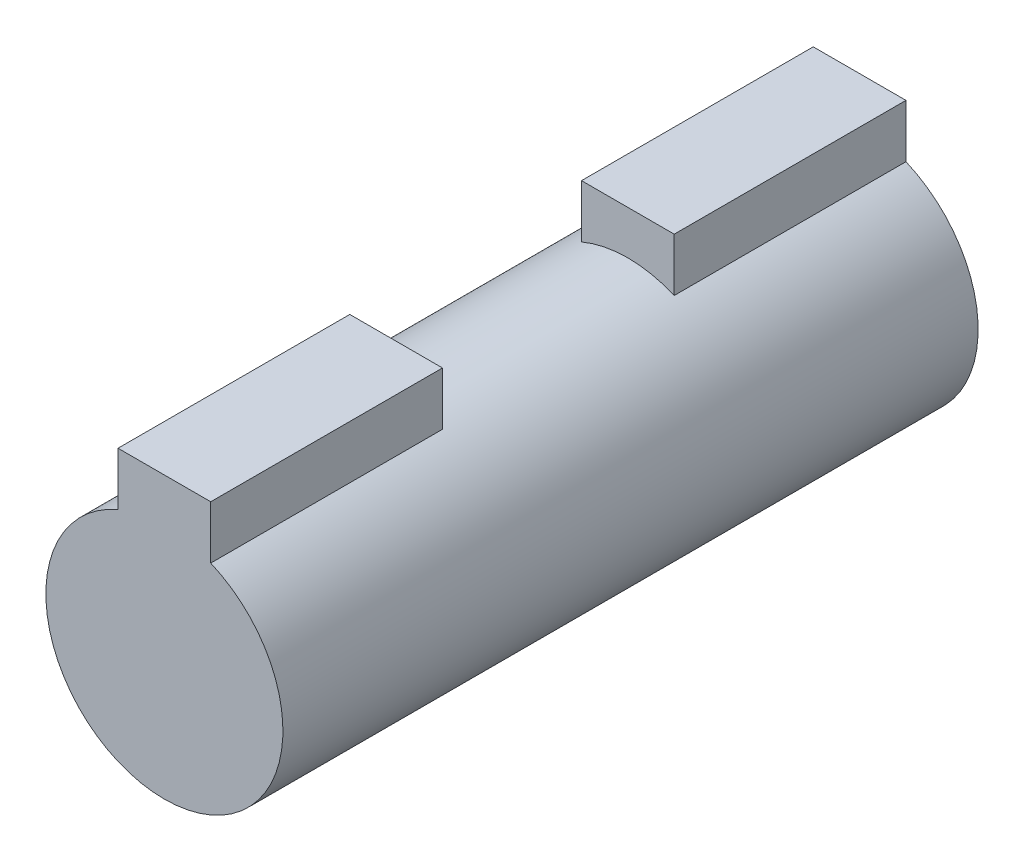
ISO-10303-21;
HEADER;
FILE_DESCRIPTION(('STEP AP214'),'2;1');
FILE_NAME('part.step','',(''),(''),'','','');
FILE_SCHEMA(('AUTOMOTIVE_DESIGN { 1 0 10303 214 1 1 1 1 }'));
ENDSEC;
DATA;
#1=APPLICATION_CONTEXT('core data for automotive mechanical design processes');
#2=APPLICATION_PROTOCOL_DEFINITION('international standard','automotive_design',2000,#1);
#3=PRODUCT_CONTEXT('',#1,'mechanical');
#4=PRODUCT('Part','Part','',(#3));
#5=PRODUCT_RELATED_PRODUCT_CATEGORY('part','',(#4));
#6=PRODUCT_DEFINITION_FORMATION('','',#4);
#7=PRODUCT_DEFINITION_CONTEXT('part definition',#1,'design');
#8=PRODUCT_DEFINITION('design','',#6,#7);
#9=PRODUCT_DEFINITION_SHAPE('','',#8);
#10=(LENGTH_UNIT() NAMED_UNIT(*) SI_UNIT(.MILLI.,.METRE.));
#11=(NAMED_UNIT(*) PLANE_ANGLE_UNIT() SI_UNIT($,.RADIAN.));
#12=(NAMED_UNIT(*) SI_UNIT($,.STERADIAN.) SOLID_ANGLE_UNIT());
#13=UNCERTAINTY_MEASURE_WITH_UNIT(LENGTH_MEASURE(1.E-05),#10,'distance_accuracy_value','');
#14=(GEOMETRIC_REPRESENTATION_CONTEXT(3) GLOBAL_UNCERTAINTY_ASSIGNED_CONTEXT((#13)) GLOBAL_UNIT_ASSIGNED_CONTEXT((#10,
#11,#12)) REPRESENTATION_CONTEXT('',''));
#15=CARTESIAN_POINT('',(0.,0.,0.));
#16=DIRECTION('',(0.,0.,1.));
#17=DIRECTION('',(1.,0.,0.));
#18=AXIS2_PLACEMENT_3D('',#15,#16,#17);
#19=CARTESIAN_POINT('',(-2.,7.,30.));
#20=DIRECTION('',(1.,0.,0.));
#21=DIRECTION('',(0.,1.,0.));
#22=AXIS2_PLACEMENT_3D('',#19,#20,#21);
#23=PLANE('',#22);
#24=DIRECTION('',(0.,-1.,0.));
#25=VECTOR('',#24,1.);
#26=CARTESIAN_POINT('',(-2.,7.,9.99999999999999));
#27=LINE('',#26,#25);
#28=CARTESIAN_POINT('',(-2.,7.,9.99999999999999));
#29=VERTEX_POINT('',#28);
#30=CARTESIAN_POINT('',(-2.,4.70724019463634,10.));
#31=VERTEX_POINT('',#30);
#32=EDGE_CURVE('E151',#29,#31,#27,.T.);
#33=ORIENTED_EDGE('',*,*,#32,.F.);
#34=DIRECTION('',(0.,0.,-1.));
#35=VECTOR('',#34,1.);
#36=CARTESIAN_POINT('',(-2.,7.,30.));
#37=LINE('',#36,#35);
#38=CARTESIAN_POINT('',(-2.,7.,0.));
#39=VERTEX_POINT('',#38);
#40=EDGE_CURVE('E79',#29,#39,#37,.T.);
#41=ORIENTED_EDGE('',*,*,#40,.T.);
#42=DIRECTION('',(0.,-1.,0.));
#43=VECTOR('',#42,1.);
#44=CARTESIAN_POINT('',(-2.,7.,0.));
#45=LINE('',#44,#43);
#46=CARTESIAN_POINT('',(-2.,4.70724019463634,0.));
#47=VERTEX_POINT('',#46);
#48=EDGE_CURVE('E149',#39,#47,#45,.T.);
#49=ORIENTED_EDGE('',*,*,#48,.T.);
#50=DIRECTION('',(0.,0.,-1.));
#51=VECTOR('',#50,1.);
#52=CARTESIAN_POINT('',(-2.,4.70724019463634,30.));
#53=LINE('',#52,#51);
#54=EDGE_CURVE('E125',#31,#47,#53,.T.);
#55=ORIENTED_EDGE('',*,*,#54,.F.);
#56=EDGE_LOOP('',(#33,#41,#49,#55));
#57=FACE_BOUND('',#56,.T.);
#58=ADVANCED_FACE('F33',(#57),#23,.F.);
#59=CARTESIAN_POINT('',(2.,7.,30.));
#60=DIRECTION('',(-1.,0.,0.));
#61=DIRECTION('',(0.,0.,1.));
#62=AXIS2_PLACEMENT_3D('',#59,#60,#61);
#63=PLANE('',#62);
#64=DIRECTION('',(0.,1.,0.));
#65=VECTOR('',#64,1.);
#66=CARTESIAN_POINT('',(2.,7.,9.99999999999999));
#67=LINE('',#66,#65);
#68=CARTESIAN_POINT('',(2.,4.70724019463634,10.));
#69=VERTEX_POINT('',#68);
#70=CARTESIAN_POINT('',(2.,7.,9.99999999999999));
#71=VERTEX_POINT('',#70);
#72=EDGE_CURVE('E157',#69,#71,#67,.T.);
#73=ORIENTED_EDGE('',*,*,#72,.F.);
#74=DIRECTION('',(0.,0.,-1.));
#75=VECTOR('',#74,1.);
#76=CARTESIAN_POINT('',(2.,4.70724019463634,30.));
#77=LINE('',#76,#75);
#78=CARTESIAN_POINT('',(2.,4.70724019463634,0.));
#79=VERTEX_POINT('',#78);
#80=EDGE_CURVE('E126',#69,#79,#77,.T.);
#81=ORIENTED_EDGE('',*,*,#80,.T.);
#82=DIRECTION('',(0.,1.,0.));
#83=VECTOR('',#82,1.);
#84=CARTESIAN_POINT('',(2.,7.,0.));
#85=LINE('',#84,#83);
#86=CARTESIAN_POINT('',(2.,7.,0.));
#87=VERTEX_POINT('',#86);
#88=EDGE_CURVE('E143',#79,#87,#85,.T.);
#89=ORIENTED_EDGE('',*,*,#88,.T.);
#90=DIRECTION('',(0.,0.,-1.));
#91=VECTOR('',#90,1.);
#92=CARTESIAN_POINT('',(2.,7.,30.));
#93=LINE('',#92,#91);
#94=EDGE_CURVE('E139',#71,#87,#93,.T.);
#95=ORIENTED_EDGE('',*,*,#94,.F.);
#96=EDGE_LOOP('',(#73,#81,#89,#95));
#97=FACE_BOUND('',#96,.T.);
#98=ADVANCED_FACE('F173',(#97),#63,.F.);
#99=CARTESIAN_POINT('',(-2.,7.,30.));
#100=DIRECTION('',(0.,-1.,0.));
#101=DIRECTION('',(0.,0.,-1.));
#102=AXIS2_PLACEMENT_3D('',#99,#100,#101);
#103=PLANE('',#102);
#104=DIRECTION('',(-1.,0.,0.));
#105=VECTOR('',#104,1.);
#106=CARTESIAN_POINT('',(-2.,7.,9.99999999999999));
#107=LINE('',#106,#105);
#108=EDGE_CURVE('E11',#71,#29,#107,.T.);
#109=ORIENTED_EDGE('',*,*,#108,.F.);
#110=ORIENTED_EDGE('',*,*,#94,.T.);
#111=DIRECTION('',(-1.,0.,0.));
#112=VECTOR('',#111,1.);
#113=CARTESIAN_POINT('',(-2.,7.,0.));
#114=LINE('',#113,#112);
#115=EDGE_CURVE('E141',#87,#39,#114,.T.);
#116=ORIENTED_EDGE('',*,*,#115,.T.);
#117=ORIENTED_EDGE('',*,*,#40,.F.);
#118=EDGE_LOOP('',(#109,#110,#116,#117));
#119=FACE_BOUND('',#118,.T.);
#120=ADVANCED_FACE('F177',(#119),#103,.F.);
#121=CARTESIAN_POINT('',(-2.,7.,30.));
#122=VERTEX_POINT('',#121);
#123=CARTESIAN_POINT('',(-2.,7.,20.));
#124=VERTEX_POINT('',#123);
#125=EDGE_CURVE('E135',#122,#124,#37,.T.);
#126=ORIENTED_EDGE('',*,*,#125,.T.);
#127=DIRECTION('',(0.,-1.,0.));
#128=VECTOR('',#127,1.);
#129=CARTESIAN_POINT('',(-2.,7.,20.));
#130=LINE('',#129,#128);
#131=CARTESIAN_POINT('',(-2.,4.70724019463634,20.));
#132=VERTEX_POINT('',#131);
#133=EDGE_CURVE('E48',#124,#132,#130,.T.);
#134=ORIENTED_EDGE('',*,*,#133,.T.);
#135=CARTESIAN_POINT('',(-2.,4.70724019463634,30.));
#136=VERTEX_POINT('',#135);
#137=EDGE_CURVE('E121',#136,#132,#53,.T.);
#138=ORIENTED_EDGE('',*,*,#137,.F.);
#139=DIRECTION('',(0.,-1.,0.));
#140=VECTOR('',#139,1.);
#141=CARTESIAN_POINT('',(-2.,7.,30.));
#142=LINE('',#141,#140);
#143=EDGE_CURVE('E138',#122,#136,#142,.T.);
#144=ORIENTED_EDGE('',*,*,#143,.F.);
#145=EDGE_LOOP('',(#126,#134,#138,#144));
#146=FACE_BOUND('',#145,.T.);
#147=ADVANCED_FACE('F35',(#146),#23,.F.);
#148=CARTESIAN_POINT('',(0.,0.,30.));
#149=DIRECTION('',(0.,0.,-1.));
#150=DIRECTION('',(-1.,0.,0.));
#151=AXIS2_PLACEMENT_3D('',#148,#149,#150);
#152=CYLINDRICAL_SURFACE('',#151,5.1145);
#153=ORIENTED_EDGE('',*,*,#137,.T.);
#154=CARTESIAN_POINT('',(0.,0.,20.));
#155=DIRECTION('',(0.,0.,1.));
#156=DIRECTION('',(1.,0.,0.));
#157=AXIS2_PLACEMENT_3D('',#154,#155,#156);
#158=CIRCLE('',#157,5.1145);
#159=CARTESIAN_POINT('',(2.,4.70724019463634,20.));
#160=VERTEX_POINT('',#159);
#161=EDGE_CURVE('E109',#160,#132,#158,.T.);
#162=ORIENTED_EDGE('',*,*,#161,.F.);
#163=CARTESIAN_POINT('',(2.,4.70724019463634,30.));
#164=VERTEX_POINT('',#163);
#165=EDGE_CURVE('E118',#164,#160,#77,.T.);
#166=ORIENTED_EDGE('',*,*,#165,.F.);
#167=CARTESIAN_POINT('',(0.,0.,30.));
#168=DIRECTION('',(0.,0.,1.));
#169=DIRECTION('',(1.,0.,0.));
#170=AXIS2_PLACEMENT_3D('',#167,#168,#169);
#171=CIRCLE('',#170,5.1145);
#172=EDGE_CURVE('E87',#136,#164,#171,.T.);
#173=ORIENTED_EDGE('',*,*,#172,.F.);
#174=EDGE_LOOP('',(#153,#162,#166,#173));
#175=FACE_BOUND('',#174,.T.);
#176=CARTESIAN_POINT('',(0.,0.,10.));
#177=DIRECTION('',(0.,0.,1.));
#178=DIRECTION('',(1.,0.,0.));
#179=AXIS2_PLACEMENT_3D('',#176,#177,#178);
#180=CIRCLE('',#179,5.1145);
#181=EDGE_CURVE('E114',#69,#31,#180,.T.);
#182=ORIENTED_EDGE('',*,*,#181,.T.);
#183=ORIENTED_EDGE('',*,*,#54,.T.);
#184=CARTESIAN_POINT('',(0.,0.,0.));
#185=DIRECTION('',(0.,0.,1.));
#186=DIRECTION('',(1.,0.,0.));
#187=AXIS2_PLACEMENT_3D('',#184,#185,#186);
#188=CIRCLE('',#187,5.1145);
#189=EDGE_CURVE('E146',#47,#79,#188,.T.);
#190=ORIENTED_EDGE('',*,*,#189,.T.);
#191=ORIENTED_EDGE('',*,*,#80,.F.);
#192=EDGE_LOOP('',(#182,#183,#190,#191));
#193=FACE_BOUND('',#192,.T.);
#194=ADVANCED_FACE('F116',(#175,#193),#152,.T.);
#195=ORIENTED_EDGE('',*,*,#165,.T.);
#196=DIRECTION('',(0.,1.,0.));
#197=VECTOR('',#196,1.);
#198=CARTESIAN_POINT('',(2.,7.,20.));
#199=LINE('',#198,#197);
#200=CARTESIAN_POINT('',(2.,7.,20.));
#201=VERTEX_POINT('',#200);
#202=EDGE_CURVE('E106',#160,#201,#199,.T.);
#203=ORIENTED_EDGE('',*,*,#202,.T.);
#204=CARTESIAN_POINT('',(2.,7.,30.));
#205=VERTEX_POINT('',#204);
#206=EDGE_CURVE('E129',#205,#201,#93,.T.);
#207=ORIENTED_EDGE('',*,*,#206,.F.);
#208=DIRECTION('',(0.,1.,0.));
#209=VECTOR('',#208,1.);
#210=CARTESIAN_POINT('',(2.,7.,30.));
#211=LINE('',#210,#209);
#212=EDGE_CURVE('E124',#164,#205,#211,.T.);
#213=ORIENTED_EDGE('',*,*,#212,.F.);
#214=EDGE_LOOP('',(#195,#203,#207,#213));
#215=FACE_BOUND('',#214,.T.);
#216=ADVANCED_FACE('F123',(#215),#63,.F.);
#217=ORIENTED_EDGE('',*,*,#206,.T.);
#218=DIRECTION('',(-1.,0.,0.));
#219=VECTOR('',#218,1.);
#220=CARTESIAN_POINT('',(-2.,7.,20.));
#221=LINE('',#220,#219);
#222=EDGE_CURVE('E41',#201,#124,#221,.T.);
#223=ORIENTED_EDGE('',*,*,#222,.T.);
#224=ORIENTED_EDGE('',*,*,#125,.F.);
#225=DIRECTION('',(-1.,0.,0.));
#226=VECTOR('',#225,1.);
#227=CARTESIAN_POINT('',(-2.,7.,30.));
#228=LINE('',#227,#226);
#229=EDGE_CURVE('E57',#205,#122,#228,.T.);
#230=ORIENTED_EDGE('',*,*,#229,.F.);
#231=EDGE_LOOP('',(#217,#223,#224,#230));
#232=FACE_BOUND('',#231,.T.);
#233=ADVANCED_FACE('F134',(#232),#103,.F.);
#234=CARTESIAN_POINT('',(0.,0.,30.));
#235=DIRECTION('',(0.,0.,1.));
#236=DIRECTION('',(1.,0.,0.));
#237=AXIS2_PLACEMENT_3D('',#234,#235,#236);
#238=PLANE('',#237);
#239=ORIENTED_EDGE('',*,*,#143,.T.);
#240=ORIENTED_EDGE('',*,*,#172,.T.);
#241=ORIENTED_EDGE('',*,*,#212,.T.);
#242=ORIENTED_EDGE('',*,*,#229,.T.);
#243=EDGE_LOOP('',(#239,#240,#241,#242));
#244=FACE_BOUND('',#243,.T.);
#245=ADVANCED_FACE('F187',(#244),#238,.T.);
#246=CARTESIAN_POINT('',(0.,0.,0.));
#247=DIRECTION('',(0.,0.,1.));
#248=DIRECTION('',(1.,0.,0.));
#249=AXIS2_PLACEMENT_3D('',#246,#247,#248);
#250=PLANE('',#249);
#251=ORIENTED_EDGE('',*,*,#48,.F.);
#252=ORIENTED_EDGE('',*,*,#115,.F.);
#253=ORIENTED_EDGE('',*,*,#88,.F.);
#254=ORIENTED_EDGE('',*,*,#189,.F.);
#255=EDGE_LOOP('',(#251,#252,#253,#254));
#256=FACE_BOUND('',#255,.T.);
#257=ADVANCED_FACE('F169',(#256),#250,.F.);
#258=CARTESIAN_POINT('',(0.,0.,10.));
#259=DIRECTION('',(0.,0.,1.));
#260=DIRECTION('',(1.,0.,0.));
#261=AXIS2_PLACEMENT_3D('',#258,#259,#260);
#262=PLANE('',#261);
#263=ORIENTED_EDGE('',*,*,#32,.T.);
#264=ORIENTED_EDGE('',*,*,#181,.F.);
#265=ORIENTED_EDGE('',*,*,#72,.T.);
#266=ORIENTED_EDGE('',*,*,#108,.T.);
#267=EDGE_LOOP('',(#263,#264,#265,#266));
#268=FACE_BOUND('',#267,.T.);
#269=ADVANCED_FACE('F175',(#268),#262,.T.);
#270=CARTESIAN_POINT('',(0.,0.,20.));
#271=DIRECTION('',(0.,0.,1.));
#272=DIRECTION('',(1.,0.,0.));
#273=AXIS2_PLACEMENT_3D('',#270,#271,#272);
#274=PLANE('',#273);
#275=ORIENTED_EDGE('',*,*,#222,.F.);
#276=ORIENTED_EDGE('',*,*,#202,.F.);
#277=ORIENTED_EDGE('',*,*,#161,.T.);
#278=ORIENTED_EDGE('',*,*,#133,.F.);
#279=EDGE_LOOP('',(#275,#276,#277,#278));
#280=FACE_BOUND('',#279,.T.);
#281=ADVANCED_FACE('F108',(#280),#274,.F.);
#282=CLOSED_SHELL('',(#58,#98,#120,#147,#194,#216,#233,#245,#257,#269,#281));
#283=MANIFOLD_SOLID_BREP('B2',#282);
#284=ADVANCED_BREP_SHAPE_REPRESENTATION('',(#18,#283),#14);
#285=SHAPE_DEFINITION_REPRESENTATION(#9,#284);
ENDSEC;
END-ISO-10303-21;
